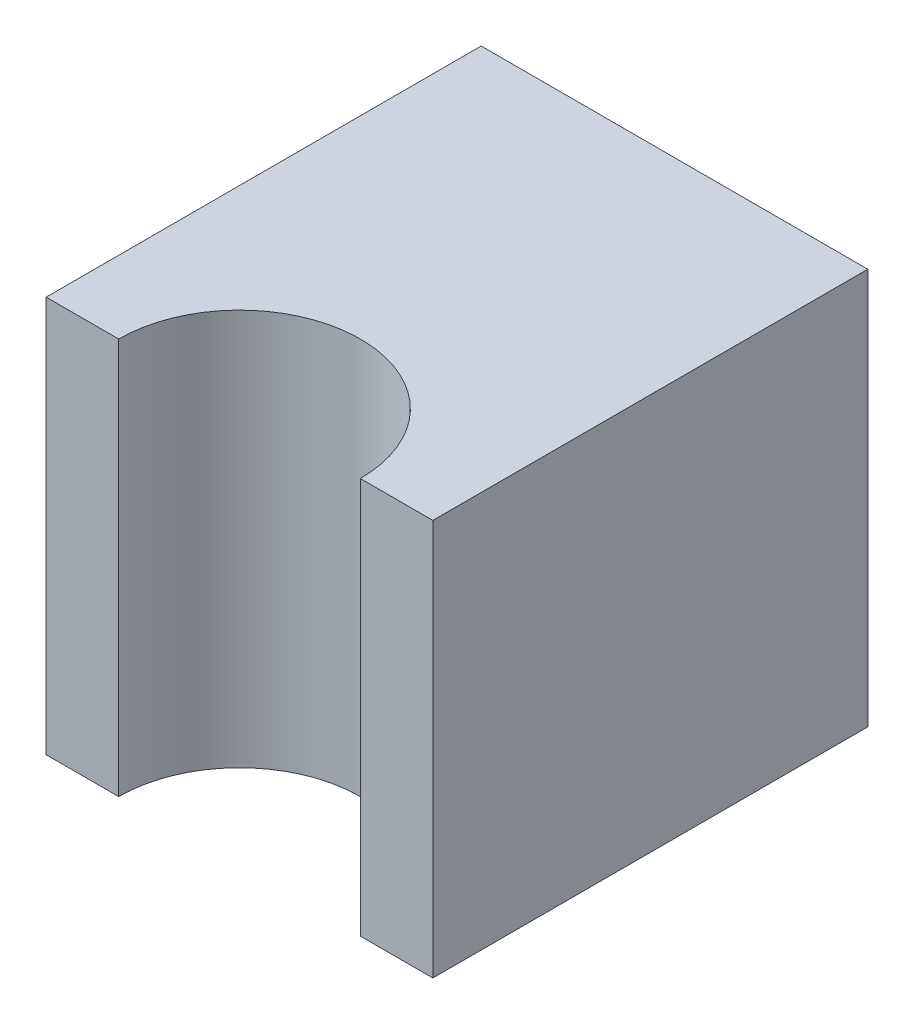
ISO-10303-21;
HEADER;
FILE_DESCRIPTION(('STEP AP214'),'2;1');
FILE_NAME('part.step','',(''),(''),'','','');
FILE_SCHEMA(('AUTOMOTIVE_DESIGN { 1 0 10303 214 1 1 1 1 }'));
ENDSEC;
DATA;
#1=APPLICATION_CONTEXT('core data for automotive mechanical design processes');
#2=APPLICATION_PROTOCOL_DEFINITION('international standard','automotive_design',2000,#1);
#3=PRODUCT_CONTEXT('',#1,'mechanical');
#4=PRODUCT('Part','Part','',(#3));
#5=PRODUCT_RELATED_PRODUCT_CATEGORY('part','',(#4));
#6=PRODUCT_DEFINITION_FORMATION('','',#4);
#7=PRODUCT_DEFINITION_CONTEXT('part definition',#1,'design');
#8=PRODUCT_DEFINITION('design','',#6,#7);
#9=PRODUCT_DEFINITION_SHAPE('','',#8);
#10=(LENGTH_UNIT() NAMED_UNIT(*) SI_UNIT(.MILLI.,.METRE.));
#11=(NAMED_UNIT(*) PLANE_ANGLE_UNIT() SI_UNIT($,.RADIAN.));
#12=(NAMED_UNIT(*) SI_UNIT($,.STERADIAN.) SOLID_ANGLE_UNIT());
#13=UNCERTAINTY_MEASURE_WITH_UNIT(LENGTH_MEASURE(1.E-05),#10,'distance_accuracy_value','');
#14=(GEOMETRIC_REPRESENTATION_CONTEXT(3) GLOBAL_UNCERTAINTY_ASSIGNED_CONTEXT((#13)) GLOBAL_UNIT_ASSIGNED_CONTEXT((#10,
#11,#12)) REPRESENTATION_CONTEXT('',''));
#15=CARTESIAN_POINT('',(0.,0.,0.));
#16=DIRECTION('',(0.,0.,1.));
#17=DIRECTION('',(1.,0.,0.));
#18=AXIS2_PLACEMENT_3D('',#15,#16,#17);
#19=CARTESIAN_POINT('',(-5.9,0.,6.1));
#20=DIRECTION('',(0.,1.,0.));
#21=DIRECTION('',(0.,0.,1.));
#22=AXIS2_PLACEMENT_3D('',#19,#20,#21);
#23=CYLINDRICAL_SURFACE('',#22,0.25);
#24=DIRECTION('',(0.,1.,0.));
#25=VECTOR('',#24,1.);
#26=CARTESIAN_POINT('',(-5.65,0.,6.1));
#27=LINE('',#26,#25);
#28=CARTESIAN_POINT('',(-5.65,0.82,6.1));
#29=VERTEX_POINT('',#28);
#30=CARTESIAN_POINT('',(-5.65,0.,6.1));
#31=VERTEX_POINT('',#30);
#32=EDGE_CURVE('E119',#29,#31,#27,.F.);
#33=ORIENTED_EDGE('',*,*,#32,.F.);
#34=CARTESIAN_POINT('',(-5.9,0.82,6.1));
#35=DIRECTION('',(0.,1.,0.));
#36=DIRECTION('',(0.,0.,1.));
#37=AXIS2_PLACEMENT_3D('',#34,#35,#36);
#38=CIRCLE('',#37,0.25);
#39=CARTESIAN_POINT('',(-6.15,0.82,6.1));
#40=VERTEX_POINT('',#39);
#41=EDGE_CURVE('E80',#40,#29,#38,.F.);
#42=ORIENTED_EDGE('',*,*,#41,.F.);
#43=DIRECTION('',(0.,1.,0.));
#44=VECTOR('',#43,1.);
#45=CARTESIAN_POINT('',(-6.15,0.,6.1));
#46=LINE('',#45,#44);
#47=CARTESIAN_POINT('',(-6.15,0.,6.1));
#48=VERTEX_POINT('',#47);
#49=EDGE_CURVE('E78',#48,#40,#46,.T.);
#50=ORIENTED_EDGE('',*,*,#49,.F.);
#51=CARTESIAN_POINT('',(-5.9,0.,6.1));
#52=DIRECTION('',(0.,1.,0.));
#53=DIRECTION('',(0.,0.,1.));
#54=AXIS2_PLACEMENT_3D('',#51,#52,#53);
#55=CIRCLE('',#54,0.25);
#56=EDGE_CURVE('E20',#48,#31,#55,.F.);
#57=ORIENTED_EDGE('',*,*,#56,.T.);
#58=EDGE_LOOP('',(#33,#42,#50,#57));
#59=FACE_BOUND('',#58,.T.);
#60=ADVANCED_FACE('F17',(#59),#23,.F.);
#61=CARTESIAN_POINT('',(-5.65,0.,6.1));
#62=DIRECTION('',(0.,0.,1.));
#63=DIRECTION('',(1.,0.,0.));
#64=AXIS2_PLACEMENT_3D('',#61,#62,#63);
#65=PLANE('',#64);
#66=DIRECTION('',(1.,0.,0.));
#67=VECTOR('',#66,1.);
#68=CARTESIAN_POINT('',(-5.9,0.82,6.1));
#69=LINE('',#68,#67);
#70=CARTESIAN_POINT('',(-5.5,0.82,6.1));
#71=VERTEX_POINT('',#70);
#72=EDGE_CURVE('E104',#29,#71,#69,.T.);
#73=ORIENTED_EDGE('',*,*,#72,.F.);
#74=ORIENTED_EDGE('',*,*,#32,.T.);
#75=DIRECTION('',(1.,0.,0.));
#76=VECTOR('',#75,1.);
#77=CARTESIAN_POINT('',(-5.9,0.,6.1));
#78=LINE('',#77,#76);
#79=CARTESIAN_POINT('',(-5.5,0.,6.1));
#80=VERTEX_POINT('',#79);
#81=EDGE_CURVE('E73',#31,#80,#78,.T.);
#82=ORIENTED_EDGE('',*,*,#81,.T.);
#83=DIRECTION('',(0.,1.,0.));
#84=VECTOR('',#83,1.);
#85=CARTESIAN_POINT('',(-5.5,0.,6.1));
#86=LINE('',#85,#84);
#87=EDGE_CURVE('E76',#71,#80,#86,.F.);
#88=ORIENTED_EDGE('',*,*,#87,.F.);
#89=EDGE_LOOP('',(#73,#74,#82,#88));
#90=FACE_BOUND('',#89,.T.);
#91=ADVANCED_FACE('F196',(#90),#65,.T.);
#92=CARTESIAN_POINT('',(-5.5,0.,6.1));
#93=DIRECTION('',(1.,0.,0.));
#94=DIRECTION('',(0.,0.,-1.));
#95=AXIS2_PLACEMENT_3D('',#92,#93,#94);
#96=PLANE('',#95);
#97=DIRECTION('',(0.,0.,1.));
#98=VECTOR('',#97,1.);
#99=CARTESIAN_POINT('',(-5.5,0.82,5.65));
#100=LINE('',#99,#98);
#101=CARTESIAN_POINT('',(-5.5,0.82,5.2));
#102=VERTEX_POINT('',#101);
#103=EDGE_CURVE('E83',#71,#102,#100,.F.);
#104=ORIENTED_EDGE('',*,*,#103,.F.);
#105=ORIENTED_EDGE('',*,*,#87,.T.);
#106=DIRECTION('',(0.,0.,1.));
#107=VECTOR('',#106,1.);
#108=CARTESIAN_POINT('',(-5.5,0.,5.65));
#109=LINE('',#108,#107);
#110=CARTESIAN_POINT('',(-5.5,0.,5.2));
#111=VERTEX_POINT('',#110);
#112=EDGE_CURVE('E89',#80,#111,#109,.F.);
#113=ORIENTED_EDGE('',*,*,#112,.T.);
#114=DIRECTION('',(0.,1.,0.));
#115=VECTOR('',#114,1.);
#116=CARTESIAN_POINT('',(-5.5,0.,5.2));
#117=LINE('',#116,#115);
#118=EDGE_CURVE('E100',#102,#111,#117,.F.);
#119=ORIENTED_EDGE('',*,*,#118,.F.);
#120=EDGE_LOOP('',(#104,#105,#113,#119));
#121=FACE_BOUND('',#120,.T.);
#122=ADVANCED_FACE('F187',(#121),#96,.T.);
#123=CARTESIAN_POINT('',(-5.9,0.,5.65));
#124=DIRECTION('',(0.,1.,0.));
#125=DIRECTION('',(0.,0.,1.));
#126=AXIS2_PLACEMENT_3D('',#123,#124,#125);
#127=PLANE('',#126);
#128=ORIENTED_EDGE('',*,*,#81,.F.);
#129=ORIENTED_EDGE('',*,*,#56,.F.);
#130=DIRECTION('',(1.,0.,0.));
#131=VECTOR('',#130,1.);
#132=CARTESIAN_POINT('',(-6.3,0.,6.1));
#133=LINE('',#132,#131);
#134=CARTESIAN_POINT('',(-6.3,0.,6.1));
#135=VERTEX_POINT('',#134);
#136=EDGE_CURVE('E70',#135,#48,#133,.T.);
#137=ORIENTED_EDGE('',*,*,#136,.F.);
#138=DIRECTION('',(0.,0.,1.));
#139=VECTOR('',#138,1.);
#140=CARTESIAN_POINT('',(-6.3,0.,5.2));
#141=LINE('',#140,#139);
#142=CARTESIAN_POINT('',(-6.3,0.,5.2));
#143=VERTEX_POINT('',#142);
#144=EDGE_CURVE('E98',#143,#135,#141,.T.);
#145=ORIENTED_EDGE('',*,*,#144,.F.);
#146=DIRECTION('',(-1.,0.,0.));
#147=VECTOR('',#146,1.);
#148=CARTESIAN_POINT('',(-5.5,0.,5.2));
#149=LINE('',#148,#147);
#150=EDGE_CURVE('E107',#111,#143,#149,.T.);
#151=ORIENTED_EDGE('',*,*,#150,.F.);
#152=ORIENTED_EDGE('',*,*,#112,.F.);
#153=EDGE_LOOP('',(#128,#129,#137,#145,#151,#152));
#154=FACE_BOUND('',#153,.T.);
#155=ADVANCED_FACE('F68',(#154),#127,.F.);
#156=CARTESIAN_POINT('',(-6.3,0.,6.1));
#157=DIRECTION('',(0.,0.,1.));
#158=DIRECTION('',(1.,0.,0.));
#159=AXIS2_PLACEMENT_3D('',#156,#157,#158);
#160=PLANE('',#159);
#161=DIRECTION('',(1.,0.,0.));
#162=VECTOR('',#161,1.);
#163=CARTESIAN_POINT('',(-5.9,0.82,6.1));
#164=LINE('',#163,#162);
#165=CARTESIAN_POINT('',(-6.3,0.82,6.1));
#166=VERTEX_POINT('',#165);
#167=EDGE_CURVE('E105',#166,#40,#164,.T.);
#168=ORIENTED_EDGE('',*,*,#167,.F.);
#169=DIRECTION('',(0.,1.,0.));
#170=VECTOR('',#169,1.);
#171=CARTESIAN_POINT('',(-6.3,0.,6.1));
#172=LINE('',#171,#170);
#173=EDGE_CURVE('E87',#135,#166,#172,.T.);
#174=ORIENTED_EDGE('',*,*,#173,.F.);
#175=ORIENTED_EDGE('',*,*,#136,.T.);
#176=ORIENTED_EDGE('',*,*,#49,.T.);
#177=EDGE_LOOP('',(#168,#174,#175,#176));
#178=FACE_BOUND('',#177,.T.);
#179=ADVANCED_FACE('F85',(#178),#160,.T.);
#180=CARTESIAN_POINT('',(-5.9,0.82,5.65));
#181=DIRECTION('',(0.,1.,0.));
#182=DIRECTION('',(0.,0.,1.));
#183=AXIS2_PLACEMENT_3D('',#180,#181,#182);
#184=PLANE('',#183);
#185=ORIENTED_EDGE('',*,*,#41,.T.);
#186=ORIENTED_EDGE('',*,*,#72,.T.);
#187=ORIENTED_EDGE('',*,*,#103,.T.);
#188=DIRECTION('',(-1.,0.,0.));
#189=VECTOR('',#188,1.);
#190=CARTESIAN_POINT('',(-5.5,0.82,5.2));
#191=LINE('',#190,#189);
#192=CARTESIAN_POINT('',(-6.3,0.82,5.2));
#193=VERTEX_POINT('',#192);
#194=EDGE_CURVE('E35',#193,#102,#191,.F.);
#195=ORIENTED_EDGE('',*,*,#194,.F.);
#196=DIRECTION('',(0.,0.,1.));
#197=VECTOR('',#196,1.);
#198=CARTESIAN_POINT('',(-6.3,0.82,5.2));
#199=LINE('',#198,#197);
#200=EDGE_CURVE('E26',#166,#193,#199,.F.);
#201=ORIENTED_EDGE('',*,*,#200,.F.);
#202=ORIENTED_EDGE('',*,*,#167,.T.);
#203=EDGE_LOOP('',(#185,#186,#187,#195,#201,#202));
#204=FACE_BOUND('',#203,.T.);
#205=ADVANCED_FACE('F145',(#204),#184,.T.);
#206=CARTESIAN_POINT('',(-5.5,0.,5.2));
#207=DIRECTION('',(0.,0.,-1.));
#208=DIRECTION('',(-1.,0.,0.));
#209=AXIS2_PLACEMENT_3D('',#206,#207,#208);
#210=PLANE('',#209);
#211=ORIENTED_EDGE('',*,*,#194,.T.);
#212=ORIENTED_EDGE('',*,*,#118,.T.);
#213=ORIENTED_EDGE('',*,*,#150,.T.);
#214=DIRECTION('',(0.,1.,0.));
#215=VECTOR('',#214,1.);
#216=CARTESIAN_POINT('',(-6.3,0.,5.2));
#217=LINE('',#216,#215);
#218=EDGE_CURVE('E11',#193,#143,#217,.F.);
#219=ORIENTED_EDGE('',*,*,#218,.F.);
#220=EDGE_LOOP('',(#211,#212,#213,#219));
#221=FACE_BOUND('',#220,.T.);
#222=ADVANCED_FACE('F141',(#221),#210,.T.);
#223=CARTESIAN_POINT('',(-6.3,0.,5.2));
#224=DIRECTION('',(-1.,0.,0.));
#225=DIRECTION('',(0.,0.,1.));
#226=AXIS2_PLACEMENT_3D('',#223,#224,#225);
#227=PLANE('',#226);
#228=ORIENTED_EDGE('',*,*,#200,.T.);
#229=ORIENTED_EDGE('',*,*,#218,.T.);
#230=ORIENTED_EDGE('',*,*,#144,.T.);
#231=ORIENTED_EDGE('',*,*,#173,.T.);
#232=EDGE_LOOP('',(#228,#229,#230,#231));
#233=FACE_BOUND('',#232,.T.);
#234=ADVANCED_FACE('F144',(#233),#227,.T.);
#235=CLOSED_SHELL('',(#60,#91,#122,#155,#179,#205,#222,#234));
#236=MANIFOLD_SOLID_BREP('B1',#235);
#237=ADVANCED_BREP_SHAPE_REPRESENTATION('',(#18,#236),#14);
#238=SHAPE_DEFINITION_REPRESENTATION(#9,#237);
ENDSEC;
END-ISO-10303-21;
